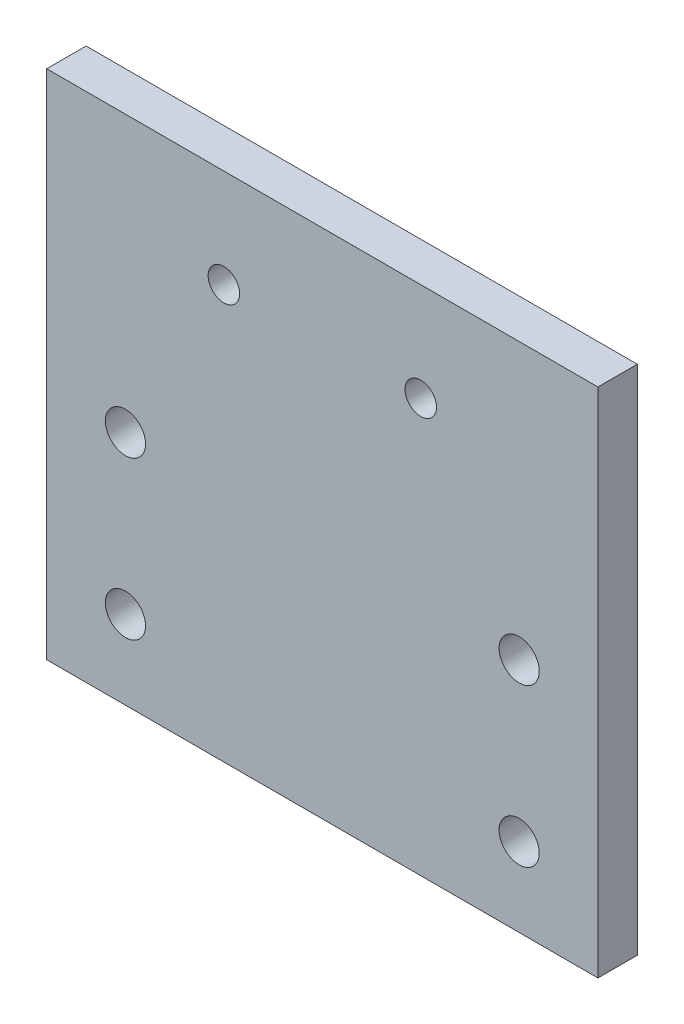
ISO-10303-21;
HEADER;
FILE_DESCRIPTION(('STEP AP214'),'2;1');
FILE_NAME('part.step','',(''),(''),'','','');
FILE_SCHEMA(('AUTOMOTIVE_DESIGN { 1 0 10303 214 1 1 1 1 }'));
ENDSEC;
DATA;
#1=APPLICATION_CONTEXT('core data for automotive mechanical design processes');
#2=APPLICATION_PROTOCOL_DEFINITION('international standard','automotive_design',2000,#1);
#3=PRODUCT_CONTEXT('',#1,'mechanical');
#4=PRODUCT('Part','Part','',(#3));
#5=PRODUCT_RELATED_PRODUCT_CATEGORY('part','',(#4));
#6=PRODUCT_DEFINITION_FORMATION('','',#4);
#7=PRODUCT_DEFINITION_CONTEXT('part definition',#1,'design');
#8=PRODUCT_DEFINITION('design','',#6,#7);
#9=PRODUCT_DEFINITION_SHAPE('','',#8);
#10=(LENGTH_UNIT() NAMED_UNIT(*) SI_UNIT(.MILLI.,.METRE.));
#11=(NAMED_UNIT(*) PLANE_ANGLE_UNIT() SI_UNIT($,.RADIAN.));
#12=(NAMED_UNIT(*) SI_UNIT($,.STERADIAN.) SOLID_ANGLE_UNIT());
#13=UNCERTAINTY_MEASURE_WITH_UNIT(LENGTH_MEASURE(1.E-05),#10,'distance_accuracy_value','');
#14=(GEOMETRIC_REPRESENTATION_CONTEXT(3) GLOBAL_UNCERTAINTY_ASSIGNED_CONTEXT((#13)) GLOBAL_UNIT_ASSIGNED_CONTEXT((#10,
#11,#12)) REPRESENTATION_CONTEXT('',''));
#15=CARTESIAN_POINT('',(0.,0.,0.));
#16=DIRECTION('',(0.,0.,1.));
#17=DIRECTION('',(1.,0.,0.));
#18=AXIS2_PLACEMENT_3D('',#15,#16,#17);
#19=CARTESIAN_POINT('',(0.,0.,5.));
#20=DIRECTION('',(0.,0.,-1.));
#21=DIRECTION('',(-1.,0.,0.));
#22=AXIS2_PLACEMENT_3D('',#19,#20,#21);
#23=PLANE('',#22);
#24=DIRECTION('',(0.,1.,0.));
#25=VECTOR('',#24,1.);
#26=CARTESIAN_POINT('',(35.,-12.5,5.));
#27=LINE('',#26,#25);
#28=CARTESIAN_POINT('',(35.,-52.5,5.));
#29=VERTEX_POINT('',#28);
#30=CARTESIAN_POINT('',(35.,12.5,5.));
#31=VERTEX_POINT('',#30);
#32=EDGE_CURVE('E57',#29,#31,#27,.T.);
#33=ORIENTED_EDGE('',*,*,#32,.T.);
#34=DIRECTION('',(-1.,0.,0.));
#35=VECTOR('',#34,1.);
#36=CARTESIAN_POINT('',(-35.,12.5,5.));
#37=LINE('',#36,#35);
#38=CARTESIAN_POINT('',(-35.,12.5,5.));
#39=VERTEX_POINT('',#38);
#40=EDGE_CURVE('E87',#31,#39,#37,.T.);
#41=ORIENTED_EDGE('',*,*,#40,.T.);
#42=DIRECTION('',(0.,-1.,0.));
#43=VECTOR('',#42,1.);
#44=CARTESIAN_POINT('',(-35.,-12.5,5.));
#45=LINE('',#44,#43);
#46=CARTESIAN_POINT('',(-35.,-52.5,5.));
#47=VERTEX_POINT('',#46);
#48=EDGE_CURVE('E91',#39,#47,#45,.T.);
#49=ORIENTED_EDGE('',*,*,#48,.T.);
#50=DIRECTION('',(1.,0.,0.));
#51=VECTOR('',#50,1.);
#52=CARTESIAN_POINT('',(-35.,-52.5,5.));
#53=LINE('',#52,#51);
#54=EDGE_CURVE('E102',#47,#29,#53,.T.);
#55=ORIENTED_EDGE('',*,*,#54,.T.);
#56=EDGE_LOOP('',(#33,#41,#49,#55));
#57=FACE_BOUND('',#56,.T.);
#58=CARTESIAN_POINT('',(-25.,-22.5,5.));
#59=DIRECTION('',(0.,0.,1.));
#60=DIRECTION('',(1.,0.,0.));
#61=AXIS2_PLACEMENT_3D('',#58,#59,#60);
#62=CIRCLE('',#61,2.55);
#63=CARTESIAN_POINT('',(-22.45,-22.5,5.));
#64=VERTEX_POINT('',#63);
#65=EDGE_CURVE('E111',#64,#64,#62,.T.);
#66=ORIENTED_EDGE('',*,*,#65,.F.);
#67=EDGE_LOOP('',(#66));
#68=FACE_BOUND('',#67,.T.);
#69=CARTESIAN_POINT('',(-25.,-42.5,5.));
#70=DIRECTION('',(0.,0.,1.));
#71=DIRECTION('',(1.,0.,0.));
#72=AXIS2_PLACEMENT_3D('',#69,#70,#71);
#73=CIRCLE('',#72,2.55);
#74=CARTESIAN_POINT('',(-22.45,-42.5,5.));
#75=VERTEX_POINT('',#74);
#76=EDGE_CURVE('E205',#75,#75,#73,.T.);
#77=ORIENTED_EDGE('',*,*,#76,.F.);
#78=EDGE_LOOP('',(#77));
#79=FACE_BOUND('',#78,.T.);
#80=CARTESIAN_POINT('',(25.,-42.5,5.));
#81=DIRECTION('',(0.,0.,1.));
#82=DIRECTION('',(-1.,0.,0.));
#83=AXIS2_PLACEMENT_3D('',#80,#81,#82);
#84=CIRCLE('',#83,2.55);
#85=CARTESIAN_POINT('',(22.45,-42.5,5.));
#86=VERTEX_POINT('',#85);
#87=EDGE_CURVE('E197',#86,#86,#84,.T.);
#88=ORIENTED_EDGE('',*,*,#87,.F.);
#89=EDGE_LOOP('',(#88));
#90=FACE_BOUND('',#89,.T.);
#91=CARTESIAN_POINT('',(25.,-22.5,5.));
#92=DIRECTION('',(0.,0.,1.));
#93=DIRECTION('',(-1.,0.,0.));
#94=AXIS2_PLACEMENT_3D('',#91,#92,#93);
#95=CIRCLE('',#94,2.55);
#96=CARTESIAN_POINT('',(22.45,-22.5,5.));
#97=VERTEX_POINT('',#96);
#98=EDGE_CURVE('E189',#97,#97,#95,.T.);
#99=ORIENTED_EDGE('',*,*,#98,.F.);
#100=EDGE_LOOP('',(#99));
#101=FACE_BOUND('',#100,.T.);
#102=CARTESIAN_POINT('',(-12.5,0.,5.));
#103=DIRECTION('',(0.,0.,1.));
#104=DIRECTION('',(1.,0.,0.));
#105=AXIS2_PLACEMENT_3D('',#102,#103,#104);
#106=CIRCLE('',#105,2.);
#107=CARTESIAN_POINT('',(-10.5,0.,5.));
#108=VERTEX_POINT('',#107);
#109=EDGE_CURVE('E181',#108,#108,#106,.T.);
#110=ORIENTED_EDGE('',*,*,#109,.F.);
#111=EDGE_LOOP('',(#110));
#112=FACE_BOUND('',#111,.T.);
#113=CARTESIAN_POINT('',(12.5,0.,5.));
#114=DIRECTION('',(0.,0.,1.));
#115=DIRECTION('',(-1.,0.,0.));
#116=AXIS2_PLACEMENT_3D('',#113,#114,#115);
#117=CIRCLE('',#116,2.);
#118=CARTESIAN_POINT('',(10.5,0.,5.));
#119=VERTEX_POINT('',#118);
#120=EDGE_CURVE('E170',#119,#119,#117,.T.);
#121=ORIENTED_EDGE('',*,*,#120,.F.);
#122=EDGE_LOOP('',(#121));
#123=FACE_BOUND('',#122,.T.);
#124=ADVANCED_FACE('F39',(#57,#68,#79,#90,#101,#112,#123),#23,.F.);
#125=CARTESIAN_POINT('',(0.,0.,0.));
#126=DIRECTION('',(0.,0.,-1.));
#127=DIRECTION('',(-1.,0.,0.));
#128=AXIS2_PLACEMENT_3D('',#125,#126,#127);
#129=PLANE('',#128);
#130=CARTESIAN_POINT('',(-12.5,0.,0.));
#131=DIRECTION('',(0.,0.,1.));
#132=DIRECTION('',(1.,0.,0.));
#133=AXIS2_PLACEMENT_3D('',#130,#131,#132);
#134=CIRCLE('',#133,2.);
#135=CARTESIAN_POINT('',(-10.5,0.,0.));
#136=VERTEX_POINT('',#135);
#137=EDGE_CURVE('E178',#136,#136,#134,.T.);
#138=ORIENTED_EDGE('',*,*,#137,.T.);
#139=EDGE_LOOP('',(#138));
#140=FACE_BOUND('',#139,.T.);
#141=CARTESIAN_POINT('',(25.,-42.5,0.));
#142=DIRECTION('',(0.,0.,1.));
#143=DIRECTION('',(-1.,0.,0.));
#144=AXIS2_PLACEMENT_3D('',#141,#142,#143);
#145=CIRCLE('',#144,2.55);
#146=CARTESIAN_POINT('',(22.45,-42.5,0.));
#147=VERTEX_POINT('',#146);
#148=EDGE_CURVE('E193',#147,#147,#145,.T.);
#149=ORIENTED_EDGE('',*,*,#148,.T.);
#150=EDGE_LOOP('',(#149));
#151=FACE_BOUND('',#150,.T.);
#152=CARTESIAN_POINT('',(-25.,-22.5,0.));
#153=DIRECTION('',(0.,0.,1.));
#154=DIRECTION('',(1.,0.,0.));
#155=AXIS2_PLACEMENT_3D('',#152,#153,#154);
#156=CIRCLE('',#155,2.55);
#157=CARTESIAN_POINT('',(-22.45,-22.5,0.));
#158=VERTEX_POINT('',#157);
#159=EDGE_CURVE('E209',#158,#158,#156,.T.);
#160=ORIENTED_EDGE('',*,*,#159,.T.);
#161=EDGE_LOOP('',(#160));
#162=FACE_BOUND('',#161,.T.);
#163=DIRECTION('',(-1.,0.,0.));
#164=VECTOR('',#163,1.);
#165=CARTESIAN_POINT('',(-35.,12.5,0.));
#166=LINE('',#165,#164);
#167=CARTESIAN_POINT('',(35.,12.5,0.));
#168=VERTEX_POINT('',#167);
#169=CARTESIAN_POINT('',(-35.,12.5,0.));
#170=VERTEX_POINT('',#169);
#171=EDGE_CURVE('E96',#168,#170,#166,.T.);
#172=ORIENTED_EDGE('',*,*,#171,.F.);
#173=DIRECTION('',(0.,1.,0.));
#174=VECTOR('',#173,1.);
#175=CARTESIAN_POINT('',(35.,-52.5,0.));
#176=LINE('',#175,#174);
#177=CARTESIAN_POINT('',(35.,-52.5,0.));
#178=VERTEX_POINT('',#177);
#179=EDGE_CURVE('E116',#178,#168,#176,.T.);
#180=ORIENTED_EDGE('',*,*,#179,.F.);
#181=DIRECTION('',(1.,0.,0.));
#182=VECTOR('',#181,1.);
#183=CARTESIAN_POINT('',(-35.,-52.5,0.));
#184=LINE('',#183,#182);
#185=CARTESIAN_POINT('',(-35.,-52.5,0.));
#186=VERTEX_POINT('',#185);
#187=EDGE_CURVE('E81',#186,#178,#184,.T.);
#188=ORIENTED_EDGE('',*,*,#187,.F.);
#189=DIRECTION('',(0.,-1.,0.));
#190=VECTOR('',#189,1.);
#191=CARTESIAN_POINT('',(-35.,-12.5,0.));
#192=LINE('',#191,#190);
#193=EDGE_CURVE('E74',#170,#186,#192,.T.);
#194=ORIENTED_EDGE('',*,*,#193,.F.);
#195=EDGE_LOOP('',(#172,#180,#188,#194));
#196=FACE_BOUND('',#195,.T.);
#197=CARTESIAN_POINT('',(-25.,-42.5,0.));
#198=DIRECTION('',(0.,0.,1.));
#199=DIRECTION('',(1.,0.,0.));
#200=AXIS2_PLACEMENT_3D('',#197,#198,#199);
#201=CIRCLE('',#200,2.55);
#202=CARTESIAN_POINT('',(-22.45,-42.5,0.));
#203=VERTEX_POINT('',#202);
#204=EDGE_CURVE('E201',#203,#203,#201,.T.);
#205=ORIENTED_EDGE('',*,*,#204,.T.);
#206=EDGE_LOOP('',(#205));
#207=FACE_BOUND('',#206,.T.);
#208=CARTESIAN_POINT('',(25.,-22.5,0.));
#209=DIRECTION('',(0.,0.,1.));
#210=DIRECTION('',(-1.,0.,0.));
#211=AXIS2_PLACEMENT_3D('',#208,#209,#210);
#212=CIRCLE('',#211,2.55);
#213=CARTESIAN_POINT('',(22.45,-22.5,0.));
#214=VERTEX_POINT('',#213);
#215=EDGE_CURVE('E185',#214,#214,#212,.T.);
#216=ORIENTED_EDGE('',*,*,#215,.T.);
#217=EDGE_LOOP('',(#216));
#218=FACE_BOUND('',#217,.T.);
#219=CARTESIAN_POINT('',(12.5,0.,0.));
#220=DIRECTION('',(0.,0.,1.));
#221=DIRECTION('',(-1.,0.,0.));
#222=AXIS2_PLACEMENT_3D('',#219,#220,#221);
#223=CIRCLE('',#222,2.);
#224=CARTESIAN_POINT('',(10.5,0.,0.));
#225=VERTEX_POINT('',#224);
#226=EDGE_CURVE('E173',#225,#225,#223,.T.);
#227=ORIENTED_EDGE('',*,*,#226,.T.);
#228=EDGE_LOOP('',(#227));
#229=FACE_BOUND('',#228,.T.);
#230=ADVANCED_FACE('F125',(#140,#151,#162,#196,#207,#218,#229),#129,.T.);
#231=CARTESIAN_POINT('',(-35.,12.5,5.));
#232=DIRECTION('',(0.,-1.,0.));
#233=DIRECTION('',(1.,0.,0.));
#234=AXIS2_PLACEMENT_3D('',#231,#232,#233);
#235=PLANE('',#234);
#236=ORIENTED_EDGE('',*,*,#171,.T.);
#237=DIRECTION('',(0.,0.,-1.));
#238=VECTOR('',#237,1.);
#239=CARTESIAN_POINT('',(-35.,12.5,5.));
#240=LINE('',#239,#238);
#241=EDGE_CURVE('E49',#39,#170,#240,.T.);
#242=ORIENTED_EDGE('',*,*,#241,.F.);
#243=ORIENTED_EDGE('',*,*,#40,.F.);
#244=DIRECTION('',(0.,0.,-1.));
#245=VECTOR('',#244,1.);
#246=CARTESIAN_POINT('',(35.,12.5,5.));
#247=LINE('',#246,#245);
#248=EDGE_CURVE('E11',#31,#168,#247,.T.);
#249=ORIENTED_EDGE('',*,*,#248,.T.);
#250=EDGE_LOOP('',(#236,#242,#243,#249));
#251=FACE_BOUND('',#250,.T.);
#252=ADVANCED_FACE('F41',(#251),#235,.F.);
#253=CARTESIAN_POINT('',(-35.,-12.5,5.));
#254=DIRECTION('',(1.,0.,0.));
#255=DIRECTION('',(0.,1.,0.));
#256=AXIS2_PLACEMENT_3D('',#253,#254,#255);
#257=PLANE('',#256);
#258=ORIENTED_EDGE('',*,*,#193,.T.);
#259=DIRECTION('',(0.,0.,-1.));
#260=VECTOR('',#259,1.);
#261=CARTESIAN_POINT('',(-35.,-52.5,5.));
#262=LINE('',#261,#260);
#263=EDGE_CURVE('E98',#47,#186,#262,.T.);
#264=ORIENTED_EDGE('',*,*,#263,.F.);
#265=ORIENTED_EDGE('',*,*,#48,.F.);
#266=ORIENTED_EDGE('',*,*,#241,.T.);
#267=EDGE_LOOP('',(#258,#264,#265,#266));
#268=FACE_BOUND('',#267,.T.);
#269=ADVANCED_FACE('F99',(#268),#257,.F.);
#270=CARTESIAN_POINT('',(-35.,-52.5,5.));
#271=DIRECTION('',(0.,1.,0.));
#272=DIRECTION('',(-1.,0.,0.));
#273=AXIS2_PLACEMENT_3D('',#270,#271,#272);
#274=PLANE('',#273);
#275=ORIENTED_EDGE('',*,*,#187,.T.);
#276=DIRECTION('',(0.,0.,-1.));
#277=VECTOR('',#276,1.);
#278=CARTESIAN_POINT('',(35.,-52.5,5.));
#279=LINE('',#278,#277);
#280=EDGE_CURVE('E105',#29,#178,#279,.T.);
#281=ORIENTED_EDGE('',*,*,#280,.F.);
#282=ORIENTED_EDGE('',*,*,#54,.F.);
#283=ORIENTED_EDGE('',*,*,#263,.T.);
#284=EDGE_LOOP('',(#275,#281,#282,#283));
#285=FACE_BOUND('',#284,.T.);
#286=ADVANCED_FACE('F122',(#285),#274,.F.);
#287=CARTESIAN_POINT('',(35.,-52.5,5.));
#288=DIRECTION('',(-1.,0.,0.));
#289=DIRECTION('',(0.,0.,1.));
#290=AXIS2_PLACEMENT_3D('',#287,#288,#289);
#291=PLANE('',#290);
#292=ORIENTED_EDGE('',*,*,#179,.T.);
#293=ORIENTED_EDGE('',*,*,#248,.F.);
#294=ORIENTED_EDGE('',*,*,#32,.F.);
#295=ORIENTED_EDGE('',*,*,#280,.T.);
#296=EDGE_LOOP('',(#292,#293,#294,#295));
#297=FACE_BOUND('',#296,.T.);
#298=ADVANCED_FACE('F127',(#297),#291,.F.);
#299=CARTESIAN_POINT('',(-25.,-22.5,5.));
#300=DIRECTION('',(0.,0.,-1.));
#301=DIRECTION('',(-1.,0.,0.));
#302=AXIS2_PLACEMENT_3D('',#299,#300,#301);
#303=CYLINDRICAL_SURFACE('',#302,2.55);
#304=ORIENTED_EDGE('',*,*,#65,.T.);
#305=EDGE_LOOP('',(#304));
#306=FACE_BOUND('',#305,.T.);
#307=ORIENTED_EDGE('',*,*,#159,.F.);
#308=EDGE_LOOP('',(#307));
#309=FACE_BOUND('',#308,.T.);
#310=ADVANCED_FACE('F129',(#306,#309),#303,.F.);
#311=CARTESIAN_POINT('',(-25.,-42.5,5.));
#312=DIRECTION('',(0.,0.,-1.));
#313=DIRECTION('',(-1.,0.,0.));
#314=AXIS2_PLACEMENT_3D('',#311,#312,#313);
#315=CYLINDRICAL_SURFACE('',#314,2.55);
#316=ORIENTED_EDGE('',*,*,#76,.T.);
#317=EDGE_LOOP('',(#316));
#318=FACE_BOUND('',#317,.T.);
#319=ORIENTED_EDGE('',*,*,#204,.F.);
#320=EDGE_LOOP('',(#319));
#321=FACE_BOUND('',#320,.T.);
#322=ADVANCED_FACE('F135',(#318,#321),#315,.F.);
#323=CARTESIAN_POINT('',(25.,-42.5,5.));
#324=DIRECTION('',(0.,0.,-1.));
#325=DIRECTION('',(-1.,0.,0.));
#326=AXIS2_PLACEMENT_3D('',#323,#324,#325);
#327=CYLINDRICAL_SURFACE('',#326,2.55);
#328=ORIENTED_EDGE('',*,*,#87,.T.);
#329=EDGE_LOOP('',(#328));
#330=FACE_BOUND('',#329,.T.);
#331=ORIENTED_EDGE('',*,*,#148,.F.);
#332=EDGE_LOOP('',(#331));
#333=FACE_BOUND('',#332,.T.);
#334=ADVANCED_FACE('F149',(#330,#333),#327,.F.);
#335=CARTESIAN_POINT('',(25.,-22.5,5.));
#336=DIRECTION('',(0.,0.,-1.));
#337=DIRECTION('',(-1.,0.,0.));
#338=AXIS2_PLACEMENT_3D('',#335,#336,#337);
#339=CYLINDRICAL_SURFACE('',#338,2.55);
#340=ORIENTED_EDGE('',*,*,#98,.T.);
#341=EDGE_LOOP('',(#340));
#342=FACE_BOUND('',#341,.T.);
#343=ORIENTED_EDGE('',*,*,#215,.F.);
#344=EDGE_LOOP('',(#343));
#345=FACE_BOUND('',#344,.T.);
#346=ADVANCED_FACE('F153',(#342,#345),#339,.F.);
#347=CARTESIAN_POINT('',(-12.5,0.,5.));
#348=DIRECTION('',(0.,0.,-1.));
#349=DIRECTION('',(-1.,0.,0.));
#350=AXIS2_PLACEMENT_3D('',#347,#348,#349);
#351=CYLINDRICAL_SURFACE('',#350,2.);
#352=ORIENTED_EDGE('',*,*,#109,.T.);
#353=EDGE_LOOP('',(#352));
#354=FACE_BOUND('',#353,.T.);
#355=ORIENTED_EDGE('',*,*,#137,.F.);
#356=EDGE_LOOP('',(#355));
#357=FACE_BOUND('',#356,.T.);
#358=ADVANCED_FACE('F157',(#354,#357),#351,.F.);
#359=CARTESIAN_POINT('',(12.5,0.,5.));
#360=DIRECTION('',(0.,0.,-1.));
#361=DIRECTION('',(-1.,0.,0.));
#362=AXIS2_PLACEMENT_3D('',#359,#360,#361);
#363=CYLINDRICAL_SURFACE('',#362,2.);
#364=ORIENTED_EDGE('',*,*,#120,.T.);
#365=EDGE_LOOP('',(#364));
#366=FACE_BOUND('',#365,.T.);
#367=ORIENTED_EDGE('',*,*,#226,.F.);
#368=EDGE_LOOP('',(#367));
#369=FACE_BOUND('',#368,.T.);
#370=ADVANCED_FACE('F161',(#366,#369),#363,.F.);
#371=CLOSED_SHELL('',(#124,#230,#252,#269,#286,#298,#310,#322,#334,#346,#358,#370));
#372=MANIFOLD_SOLID_BREP('B2',#371);
#373=ADVANCED_BREP_SHAPE_REPRESENTATION('',(#18,#372),#14);
#374=SHAPE_DEFINITION_REPRESENTATION(#9,#373);
ENDSEC;
END-ISO-10303-21;
